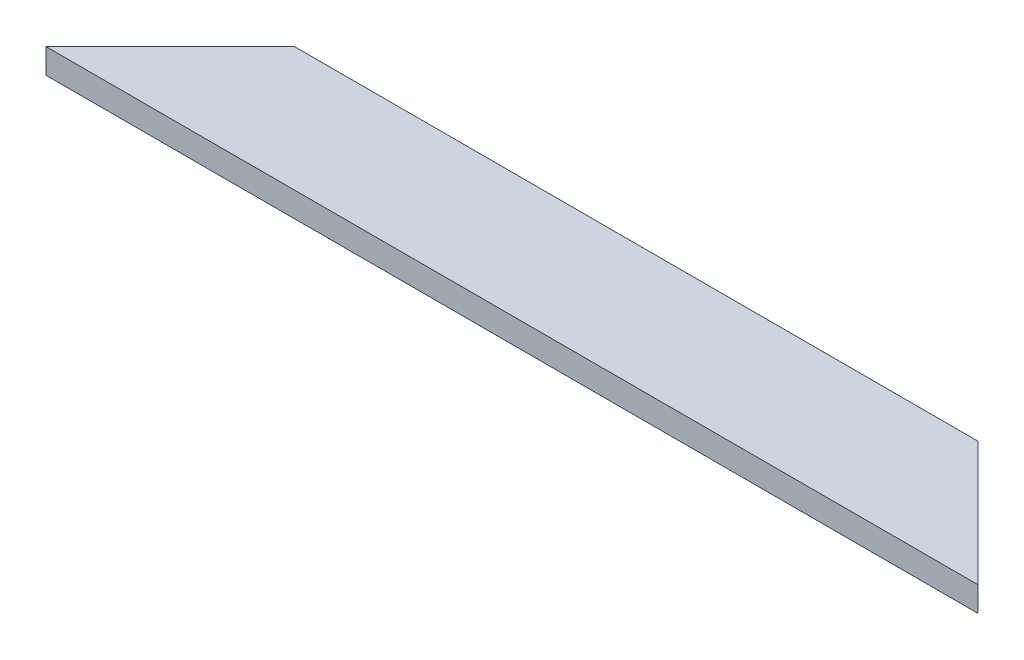
ISO-10303-21;
HEADER;
FILE_DESCRIPTION(('STEP AP214'),'2;1');
FILE_NAME('part.step','',(''),(''),'','','');
FILE_SCHEMA(('AUTOMOTIVE_DESIGN { 1 0 10303 214 1 1 1 1 }'));
ENDSEC;
DATA;
#1=APPLICATION_CONTEXT('core data for automotive mechanical design processes');
#2=APPLICATION_PROTOCOL_DEFINITION('international standard','automotive_design',2000,#1);
#3=PRODUCT_CONTEXT('',#1,'mechanical');
#4=PRODUCT('Part','Part','',(#3));
#5=PRODUCT_RELATED_PRODUCT_CATEGORY('part','',(#4));
#6=PRODUCT_DEFINITION_FORMATION('','',#4);
#7=PRODUCT_DEFINITION_CONTEXT('part definition',#1,'design');
#8=PRODUCT_DEFINITION('design','',#6,#7);
#9=PRODUCT_DEFINITION_SHAPE('','',#8);
#10=(LENGTH_UNIT() NAMED_UNIT(*) SI_UNIT(.MILLI.,.METRE.));
#11=(NAMED_UNIT(*) PLANE_ANGLE_UNIT() SI_UNIT($,.RADIAN.));
#12=(NAMED_UNIT(*) SI_UNIT($,.STERADIAN.) SOLID_ANGLE_UNIT());
#13=UNCERTAINTY_MEASURE_WITH_UNIT(LENGTH_MEASURE(1.E-05),#10,'distance_accuracy_value','');
#14=(GEOMETRIC_REPRESENTATION_CONTEXT(3) GLOBAL_UNCERTAINTY_ASSIGNED_CONTEXT((#13)) GLOBAL_UNIT_ASSIGNED_CONTEXT((#10,
#11,#12)) REPRESENTATION_CONTEXT('',''));
#15=CARTESIAN_POINT('',(0.,0.,0.));
#16=DIRECTION('',(0.,0.,1.));
#17=DIRECTION('',(1.,0.,0.));
#18=AXIS2_PLACEMENT_3D('',#15,#16,#17);
#19=CARTESIAN_POINT('',(150.,0.,0.));
#20=DIRECTION('',(0.,1.,0.));
#21=DIRECTION('',(0.,0.,1.));
#22=AXIS2_PLACEMENT_3D('',#19,#20,#21);
#23=PLANE('',#22);
#24=DIRECTION('',(-0.707106781186551,0.,0.707106781186544));
#25=VECTOR('',#24,1.);
#26=CARTESIAN_POINT('',(75.0000000000008,0.,-75.));
#27=LINE('',#26,#25);
#28=CARTESIAN_POINT('',(20.0000000000002,0.,-20.));
#29=VERTEX_POINT('',#28);
#30=CARTESIAN_POINT('',(0.,0.,0.));
#31=VERTEX_POINT('',#30);
#32=EDGE_CURVE('E99',#29,#31,#27,.T.);
#33=ORIENTED_EDGE('',*,*,#32,.F.);
#34=DIRECTION('',(-1.,0.,0.));
#35=VECTOR('',#34,1.);
#36=CARTESIAN_POINT('',(150.,0.,-20.));
#37=LINE('',#36,#35);
#38=CARTESIAN_POINT('',(130.,0.,-20.));
#39=VERTEX_POINT('',#38);
#40=EDGE_CURVE('E42',#39,#29,#37,.T.);
#41=ORIENTED_EDGE('',*,*,#40,.F.);
#42=DIRECTION('',(-0.707106781186552,0.,-0.707106781186543));
#43=VECTOR('',#42,1.);
#44=CARTESIAN_POINT('',(150.,0.,0.));
#45=LINE('',#44,#43);
#46=CARTESIAN_POINT('',(150.,0.,0.));
#47=VERTEX_POINT('',#46);
#48=EDGE_CURVE('E71',#47,#39,#45,.T.);
#49=ORIENTED_EDGE('',*,*,#48,.F.);
#50=DIRECTION('',(-1.,0.,0.));
#51=VECTOR('',#50,1.);
#52=CARTESIAN_POINT('',(150.,0.,0.));
#53=LINE('',#52,#51);
#54=EDGE_CURVE('E12',#47,#31,#53,.T.);
#55=ORIENTED_EDGE('',*,*,#54,.T.);
#56=EDGE_LOOP('',(#33,#41,#49,#55));
#57=FACE_BOUND('',#56,.T.);
#58=ADVANCED_FACE('F33',(#57),#23,.F.);
#59=CARTESIAN_POINT('',(150.,0.,-20.));
#60=DIRECTION('',(0.,0.,1.));
#61=DIRECTION('',(1.,0.,0.));
#62=AXIS2_PLACEMENT_3D('',#59,#60,#61);
#63=PLANE('',#62);
#64=DIRECTION('',(0.,1.,0.));
#65=VECTOR('',#64,1.);
#66=CARTESIAN_POINT('',(20.0000000000002,-6.,-20.));
#67=LINE('',#66,#65);
#68=CARTESIAN_POINT('',(20.0000000000002,4.,-20.));
#69=VERTEX_POINT('',#68);
#70=EDGE_CURVE('E76',#29,#69,#67,.T.);
#71=ORIENTED_EDGE('',*,*,#70,.T.);
#72=DIRECTION('',(-1.,0.,0.));
#73=VECTOR('',#72,1.);
#74=CARTESIAN_POINT('',(150.,4.,-20.));
#75=LINE('',#74,#73);
#76=CARTESIAN_POINT('',(130.,4.,-20.));
#77=VERTEX_POINT('',#76);
#78=EDGE_CURVE('E83',#77,#69,#75,.T.);
#79=ORIENTED_EDGE('',*,*,#78,.F.);
#80=DIRECTION('',(0.,1.,0.));
#81=VECTOR('',#80,1.);
#82=CARTESIAN_POINT('',(130.,-6.,-20.));
#83=LINE('',#82,#81);
#84=EDGE_CURVE('E68',#39,#77,#83,.T.);
#85=ORIENTED_EDGE('',*,*,#84,.F.);
#86=ORIENTED_EDGE('',*,*,#40,.T.);
#87=EDGE_LOOP('',(#71,#79,#85,#86));
#88=FACE_BOUND('',#87,.T.);
#89=ADVANCED_FACE('F89',(#88),#63,.F.);
#90=CARTESIAN_POINT('',(150.,4.,0.));
#91=DIRECTION('',(0.,-1.,0.));
#92=DIRECTION('',(0.,0.,-1.));
#93=AXIS2_PLACEMENT_3D('',#90,#91,#92);
#94=PLANE('',#93);
#95=DIRECTION('',(-0.707106781186551,0.,0.707106781186544));
#96=VECTOR('',#95,1.);
#97=CARTESIAN_POINT('',(20.0000000000002,4.,-20.));
#98=LINE('',#97,#96);
#99=CARTESIAN_POINT('',(0.,4.,0.));
#100=VERTEX_POINT('',#99);
#101=EDGE_CURVE('E77',#69,#100,#98,.T.);
#102=ORIENTED_EDGE('',*,*,#101,.T.);
#103=DIRECTION('',(-1.,0.,0.));
#104=VECTOR('',#103,1.);
#105=CARTESIAN_POINT('',(150.,4.,0.));
#106=LINE('',#105,#104);
#107=CARTESIAN_POINT('',(150.,4.,0.));
#108=VERTEX_POINT('',#107);
#109=EDGE_CURVE('E85',#108,#100,#106,.T.);
#110=ORIENTED_EDGE('',*,*,#109,.F.);
#111=DIRECTION('',(-0.707106781186552,0.,-0.707106781186543));
#112=VECTOR('',#111,1.);
#113=CARTESIAN_POINT('',(150.,4.,0.));
#114=LINE('',#113,#112);
#115=EDGE_CURVE('E48',#108,#77,#114,.T.);
#116=ORIENTED_EDGE('',*,*,#115,.T.);
#117=ORIENTED_EDGE('',*,*,#78,.T.);
#118=EDGE_LOOP('',(#102,#110,#116,#117));
#119=FACE_BOUND('',#118,.T.);
#120=ADVANCED_FACE('F82',(#119),#94,.F.);
#121=CARTESIAN_POINT('',(150.,0.,0.));
#122=DIRECTION('',(0.,0.,-1.));
#123=DIRECTION('',(-1.,0.,0.));
#124=AXIS2_PLACEMENT_3D('',#121,#122,#123);
#125=PLANE('',#124);
#126=DIRECTION('',(0.,-1.,0.));
#127=VECTOR('',#126,1.);
#128=CARTESIAN_POINT('',(0.,0.,0.));
#129=LINE('',#128,#127);
#130=EDGE_CURVE('E94',#100,#31,#129,.T.);
#131=ORIENTED_EDGE('',*,*,#130,.T.);
#132=ORIENTED_EDGE('',*,*,#54,.F.);
#133=DIRECTION('',(0.,-1.,0.));
#134=VECTOR('',#133,1.);
#135=CARTESIAN_POINT('',(150.,0.,0.));
#136=LINE('',#135,#134);
#137=EDGE_CURVE('E91',#108,#47,#136,.T.);
#138=ORIENTED_EDGE('',*,*,#137,.F.);
#139=ORIENTED_EDGE('',*,*,#109,.T.);
#140=EDGE_LOOP('',(#131,#132,#138,#139));
#141=FACE_BOUND('',#140,.T.);
#142=ADVANCED_FACE('F35',(#141),#125,.F.);
#143=CARTESIAN_POINT('',(20.0000000000002,-6.,-20.));
#144=DIRECTION('',(-0.707106781186544,0.,-0.707106781186551));
#145=DIRECTION('',(-0.707106781186551,0.,0.707106781186544));
#146=AXIS2_PLACEMENT_3D('',#143,#144,#145);
#147=PLANE('',#146);
#148=ORIENTED_EDGE('',*,*,#32,.T.);
#149=ORIENTED_EDGE('',*,*,#130,.F.);
#150=ORIENTED_EDGE('',*,*,#101,.F.);
#151=ORIENTED_EDGE('',*,*,#70,.F.);
#152=EDGE_LOOP('',(#148,#149,#150,#151));
#153=FACE_BOUND('',#152,.T.);
#154=ADVANCED_FACE('F107',(#153),#147,.T.);
#155=CARTESIAN_POINT('',(150.,-6.,0.));
#156=DIRECTION('',(0.707106781186543,0.,-0.707106781186552));
#157=DIRECTION('',(-0.707106781186552,0.,-0.707106781186543));
#158=AXIS2_PLACEMENT_3D('',#155,#156,#157);
#159=PLANE('',#158);
#160=ORIENTED_EDGE('',*,*,#48,.T.);
#161=ORIENTED_EDGE('',*,*,#84,.T.);
#162=ORIENTED_EDGE('',*,*,#115,.F.);
#163=ORIENTED_EDGE('',*,*,#137,.T.);
#164=EDGE_LOOP('',(#160,#161,#162,#163));
#165=FACE_BOUND('',#164,.T.);
#166=ADVANCED_FACE('F69',(#165),#159,.T.);
#167=CLOSED_SHELL('',(#58,#89,#120,#142,#154,#166));
#168=MANIFOLD_SOLID_BREP('B2',#167);
#169=ADVANCED_BREP_SHAPE_REPRESENTATION('',(#18,#168),#14);
#170=SHAPE_DEFINITION_REPRESENTATION(#9,#169);
ENDSEC;
END-ISO-10303-21;
